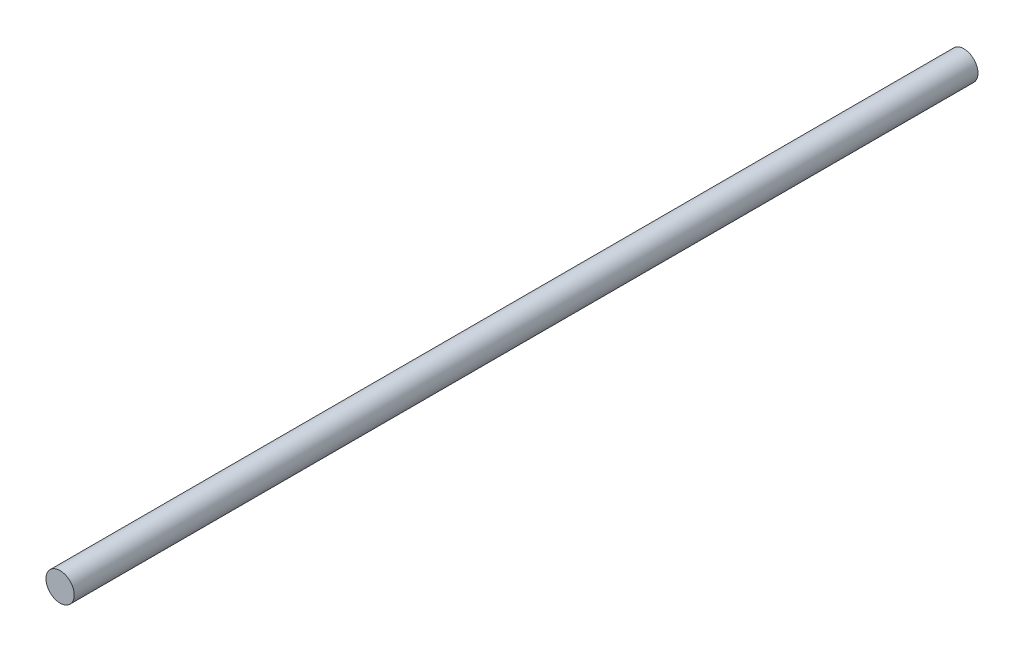
ISO-10303-21;
HEADER;
FILE_DESCRIPTION(('STEP AP214'),'2;1');
FILE_NAME('part.step','',(''),(''),'','','');
FILE_SCHEMA(('AUTOMOTIVE_DESIGN { 1 0 10303 214 1 1 1 1 }'));
ENDSEC;
DATA;
#1=APPLICATION_CONTEXT('core data for automotive mechanical design processes');
#2=APPLICATION_PROTOCOL_DEFINITION('international standard','automotive_design',2000,#1);
#3=PRODUCT_CONTEXT('',#1,'mechanical');
#4=PRODUCT('Part','Part','',(#3));
#5=PRODUCT_RELATED_PRODUCT_CATEGORY('part','',(#4));
#6=PRODUCT_DEFINITION_FORMATION('','',#4);
#7=PRODUCT_DEFINITION_CONTEXT('part definition',#1,'design');
#8=PRODUCT_DEFINITION('design','',#6,#7);
#9=PRODUCT_DEFINITION_SHAPE('','',#8);
#10=(LENGTH_UNIT() NAMED_UNIT(*) SI_UNIT(.MILLI.,.METRE.));
#11=(NAMED_UNIT(*) PLANE_ANGLE_UNIT() SI_UNIT($,.RADIAN.));
#12=(NAMED_UNIT(*) SI_UNIT($,.STERADIAN.) SOLID_ANGLE_UNIT());
#13=UNCERTAINTY_MEASURE_WITH_UNIT(LENGTH_MEASURE(1.E-05),#10,'distance_accuracy_value','');
#14=(GEOMETRIC_REPRESENTATION_CONTEXT(3) GLOBAL_UNCERTAINTY_ASSIGNED_CONTEXT((#13)) GLOBAL_UNIT_ASSIGNED_CONTEXT((#10,
#11,#12)) REPRESENTATION_CONTEXT('',''));
#15=CARTESIAN_POINT('',(0.,0.,0.));
#16=DIRECTION('',(0.,0.,1.));
#17=DIRECTION('',(1.,0.,0.));
#18=AXIS2_PLACEMENT_3D('',#15,#16,#17);
#19=CARTESIAN_POINT('',(0.,0.,96.));
#20=DIRECTION('',(0.,0.,-1.));
#21=DIRECTION('',(-1.,0.,0.));
#22=AXIS2_PLACEMENT_3D('',#19,#20,#21);
#23=CYLINDRICAL_SURFACE('',#22,1.5);
#24=CARTESIAN_POINT('',(0.,0.,96.));
#25=DIRECTION('',(0.,0.,1.));
#26=DIRECTION('',(1.,0.,0.));
#27=AXIS2_PLACEMENT_3D('',#24,#25,#26);
#28=CIRCLE('',#27,1.5);
#29=CARTESIAN_POINT('',(1.5,0.,96.));
#30=VERTEX_POINT('',#29);
#31=EDGE_CURVE('E10',#30,#30,#28,.T.);
#32=ORIENTED_EDGE('',*,*,#31,.F.);
#33=EDGE_LOOP('',(#32));
#34=FACE_BOUND('',#33,.T.);
#35=CARTESIAN_POINT('',(0.,0.,0.));
#36=DIRECTION('',(0.,0.,1.));
#37=DIRECTION('',(1.,0.,0.));
#38=AXIS2_PLACEMENT_3D('',#35,#36,#37);
#39=CIRCLE('',#38,1.5);
#40=CARTESIAN_POINT('',(1.5,0.,0.));
#41=VERTEX_POINT('',#40);
#42=EDGE_CURVE('E34',#41,#41,#39,.T.);
#43=ORIENTED_EDGE('',*,*,#42,.T.);
#44=EDGE_LOOP('',(#43));
#45=FACE_BOUND('',#44,.T.);
#46=ADVANCED_FACE('F31',(#34,#45),#23,.T.);
#47=CARTESIAN_POINT('',(0.,0.,96.));
#48=DIRECTION('',(0.,0.,1.));
#49=DIRECTION('',(1.,0.,0.));
#50=AXIS2_PLACEMENT_3D('',#47,#48,#49);
#51=PLANE('',#50);
#52=ORIENTED_EDGE('',*,*,#31,.T.);
#53=EDGE_LOOP('',(#52));
#54=FACE_BOUND('',#53,.T.);
#55=ADVANCED_FACE('F46',(#54),#51,.T.);
#56=CARTESIAN_POINT('',(0.,0.,0.));
#57=DIRECTION('',(0.,0.,1.));
#58=DIRECTION('',(1.,0.,0.));
#59=AXIS2_PLACEMENT_3D('',#56,#57,#58);
#60=PLANE('',#59);
#61=ORIENTED_EDGE('',*,*,#42,.F.);
#62=EDGE_LOOP('',(#61));
#63=FACE_BOUND('',#62,.T.);
#64=ADVANCED_FACE('F44',(#63),#60,.F.);
#65=CLOSED_SHELL('',(#46,#55,#64));
#66=MANIFOLD_SOLID_BREP('B2',#65);
#67=ADVANCED_BREP_SHAPE_REPRESENTATION('',(#18,#66),#14);
#68=SHAPE_DEFINITION_REPRESENTATION(#9,#67);
ENDSEC;
END-ISO-10303-21;
